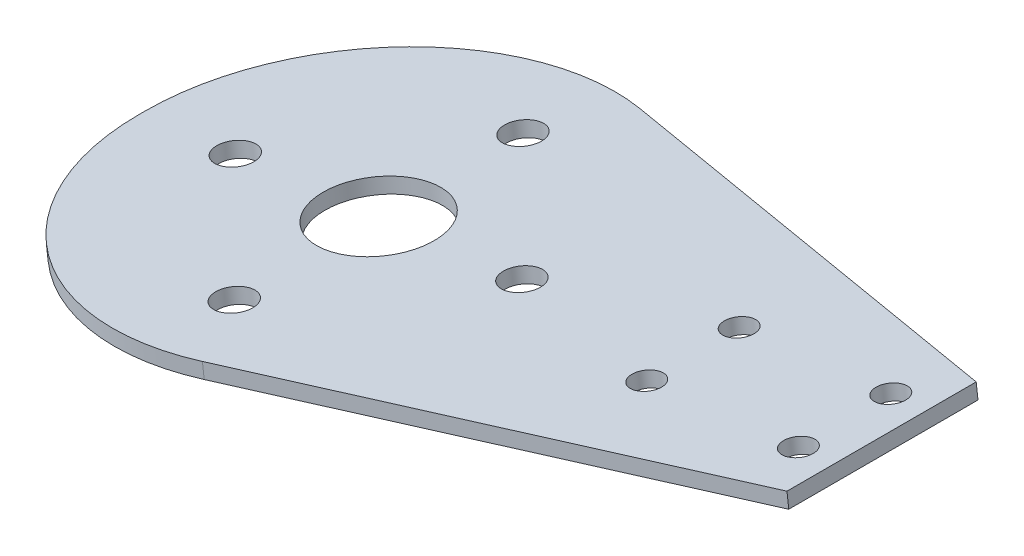
ISO-10303-21;
HEADER;
FILE_DESCRIPTION(('STEP AP214'),'2;1');
FILE_NAME('part.step','',(''),(''),'','','');
FILE_SCHEMA(('AUTOMOTIVE_DESIGN { 1 0 10303 214 1 1 1 1 }'));
ENDSEC;
DATA;
#1=APPLICATION_CONTEXT('core data for automotive mechanical design processes');
#2=APPLICATION_PROTOCOL_DEFINITION('international standard','automotive_design',2000,#1);
#3=PRODUCT_CONTEXT('',#1,'mechanical');
#4=PRODUCT('Part','Part','',(#3));
#5=PRODUCT_RELATED_PRODUCT_CATEGORY('part','',(#4));
#6=PRODUCT_DEFINITION_FORMATION('','',#4);
#7=PRODUCT_DEFINITION_CONTEXT('part definition',#1,'design');
#8=PRODUCT_DEFINITION('design','',#6,#7);
#9=PRODUCT_DEFINITION_SHAPE('','',#8);
#10=(LENGTH_UNIT() NAMED_UNIT(*) SI_UNIT(.MILLI.,.METRE.));
#11=(NAMED_UNIT(*) PLANE_ANGLE_UNIT() SI_UNIT($,.RADIAN.));
#12=(NAMED_UNIT(*) SI_UNIT($,.STERADIAN.) SOLID_ANGLE_UNIT());
#13=UNCERTAINTY_MEASURE_WITH_UNIT(LENGTH_MEASURE(1.E-05),#10,'distance_accuracy_value','');
#14=(GEOMETRIC_REPRESENTATION_CONTEXT(3) GLOBAL_UNCERTAINTY_ASSIGNED_CONTEXT((#13)) GLOBAL_UNIT_ASSIGNED_CONTEXT((#10,
#11,#12)) REPRESENTATION_CONTEXT('',''));
#15=CARTESIAN_POINT('',(0.,0.,0.));
#16=DIRECTION('',(0.,0.,1.));
#17=DIRECTION('',(1.,0.,0.));
#18=AXIS2_PLACEMENT_3D('',#15,#16,#17);
#19=CARTESIAN_POINT('',(-3583.17237333634,-433.611501662894,0.));
#20=DIRECTION('',(0.992757341933153,0.120136838804012,0.));
#21=DIRECTION('',(-0.120136838804012,0.992757341933153,0.));
#22=AXIS2_PLACEMENT_3D('',#19,#20,#21);
#23=PLANE('',#22);
#24=DIRECTION('',(0.,0.,1.));
#25=VECTOR('',#24,1.);
#26=CARTESIAN_POINT('',(-3586.22384903871,-408.395465204684,0.));
#27=LINE('',#26,#25);
#28=CARTESIAN_POINT('',(-3586.22384902271,-408.395465174607,0.7963161158));
#29=VERTEX_POINT('',#28);
#30=CARTESIAN_POINT('',(-3586.22384872111,-408.39546513811,-0.7963156247308));
#31=VERTEX_POINT('',#30);
#32=EDGE_CURVE('E76',#29,#31,#27,.F.);
#33=ORIENTED_EDGE('',*,*,#32,.F.);
#34=DIRECTION('',(-0.120136753304914,0.992757352279677,0.));
#35=VECTOR('',#34,1.);
#36=CARTESIAN_POINT('',(-3586.461719765,-406.4298056965,0.7963161158));
#37=LINE('',#36,#35);
#38=CARTESIAN_POINT('',(-3586.70439620694,-404.424435786048,0.796316115799999));
#39=VERTEX_POINT('',#38);
#40=EDGE_CURVE('E72',#29,#39,#37,.T.);
#41=ORIENTED_EDGE('',*,*,#40,.T.);
#42=DIRECTION('',(0.,0.,1.));
#43=VECTOR('',#42,1.);
#44=CARTESIAN_POINT('',(-3586.70439638072,-404.424435946072,0.));
#45=LINE('',#44,#43);
#46=CARTESIAN_POINT('',(-3586.70439653471,-404.424435825713,-0.796316115799763));
#47=VERTEX_POINT('',#46);
#48=EDGE_CURVE('E67',#47,#39,#45,.T.);
#49=ORIENTED_EDGE('',*,*,#48,.F.);
#50=DIRECTION('',(0.120137067988596,-0.992757314198713,2.45534482288628E-07));
#51=VECTOR('',#50,1.);
#52=CARTESIAN_POINT('',(-3586.46652376997,-406.390107782123,-0.796315629638174));
#53=LINE('',#52,#51);
#54=EDGE_CURVE('E69',#47,#31,#53,.T.);
#55=ORIENTED_EDGE('',*,*,#54,.T.);
#56=EDGE_LOOP('',(#33,#41,#49,#55));
#57=FACE_BOUND('',#56,.T.);
#58=ADVANCED_FACE('F17',(#57),#23,.F.);
#59=CARTESIAN_POINT('',(-3526.65840768473,-401.187257405238,-0.7963161158));
#60=DIRECTION('',(-0.1201370026744,0.992757322102643,0.));
#61=DIRECTION('',(-0.992757322102643,-0.1201370026744,0.));
#62=AXIS2_PLACEMENT_3D('',#59,#60,#61);
#63=CYLINDRICAL_SURFACE('',#62,60.0000000138993);
#64=DIRECTION('',(0.120136756247628,-0.992757351923569,-2.22863707248788E-08));
#65=VECTOR('',#64,1.);
#66=CARTESIAN_POINT('',(-3511.72228495053,-395.350603394013,-58.7518658759733));
#67=LINE('',#66,#65);
#68=CARTESIAN_POINT('',(-3511.72228516459,-395.350603332753,-58.7518657649794));
#69=VERTEX_POINT('',#68);
#70=CARTESIAN_POINT('',(-3511.24173779928,-399.3216326994,-58.7518657808039));
#71=VERTEX_POINT('',#70);
#72=EDGE_CURVE('E98',#69,#71,#67,.T.);
#73=ORIENTED_EDGE('',*,*,#72,.T.);
#74=CARTESIAN_POINT('',(-3526.65840800178,-401.187254785262,-0.7963161158));
#75=DIRECTION('',(-0.120136838804012,0.992757341933153,0.));
#76=DIRECTION('',(-0.992757341933153,-0.120136838804012,0.));
#77=AXIS2_PLACEMENT_3D('',#74,#75,#76);
#78=CIRCLE('',#77,60.0000000138993);
#79=EDGE_CURVE('E83',#71,#31,#78,.T.);
#80=ORIENTED_EDGE('',*,*,#79,.T.);
#81=ORIENTED_EDGE('',*,*,#54,.F.);
#82=CARTESIAN_POINT('',(-3527.1389560125,-397.216225496719,-0.796316115799996));
#83=DIRECTION('',(-0.120136838804012,0.992757341933153,0.));
#84=DIRECTION('',(-0.992757341933153,-0.120136838804012,0.));
#85=AXIS2_PLACEMENT_3D('',#82,#83,#84);
#86=CIRCLE('',#85,60.0000000138993);
#87=EDGE_CURVE('E20',#47,#69,#86,.F.);
#88=ORIENTED_EDGE('',*,*,#87,.T.);
#89=EDGE_LOOP('',(#73,#80,#81,#88));
#90=FACE_BOUND('',#89,.T.);
#91=ADVANCED_FACE('F80',(#90),#63,.T.);
#92=CARTESIAN_POINT('',(-3522.68737831009,-400.706705137537,0.));
#93=DIRECTION('',(-0.120136990747282,0.992757323545985,0.));
#94=DIRECTION('',(-0.992757323545985,-0.120136990747282,0.));
#95=AXIS2_PLACEMENT_3D('',#92,#93,#94);
#96=CYLINDRICAL_SURFACE('',#95,15.0000003644637);
#97=CARTESIAN_POINT('',(-3522.68737804135,-400.706707358321,0.));
#98=DIRECTION('',(-0.120136838804012,0.992757341933153,0.));
#99=DIRECTION('',(-0.992757341933153,-0.120136838804012,0.));
#100=AXIS2_PLACEMENT_3D('',#97,#98,#99);
#101=CIRCLE('',#100,15.0000003644637);
#102=CARTESIAN_POINT('',(-3537.57873853217,-402.508759984167,0.));
#103=VERTEX_POINT('',#102);
#104=EDGE_CURVE('E127',#103,#103,#101,.F.);
#105=ORIENTED_EDGE('',*,*,#104,.T.);
#106=EDGE_LOOP('',(#105));
#107=FACE_BOUND('',#106,.T.);
#108=CARTESIAN_POINT('',(-3523.16792600435,-396.735678064005,0.));
#109=DIRECTION('',(-0.120136838804012,0.992757341933153,0.));
#110=DIRECTION('',(-0.992757341933153,-0.120136838804012,0.));
#111=AXIS2_PLACEMENT_3D('',#108,#109,#110);
#112=CIRCLE('',#111,14.9999993777135);
#113=CARTESIAN_POINT('',(-3538.05928551557,-398.537730571305,0.));
#114=VERTEX_POINT('',#113);
#115=EDGE_CURVE('E90',#114,#114,#112,.T.);
#116=ORIENTED_EDGE('',*,*,#115,.T.);
#117=EDGE_LOOP('',(#116));
#118=FACE_BOUND('',#117,.T.);
#119=ADVANCED_FACE('F160',(#107,#118),#96,.F.);
#120=CARTESIAN_POINT('',(-3438.30300410119,-390.495075563839,12.4));
#121=DIRECTION('',(-0.12013699074812,0.992757323545884,0.));
#122=DIRECTION('',(-0.992757323545884,-0.12013699074812,0.));
#123=AXIS2_PLACEMENT_3D('',#120,#121,#122);
#124=CYLINDRICAL_SURFACE('',#123,4.00000012467592);
#125=CARTESIAN_POINT('',(-3438.30300404022,-390.495076067627,12.4));
#126=DIRECTION('',(-0.120136838804012,0.992757341933153,0.));
#127=DIRECTION('',(-0.992757341933153,-0.120136838804012,0.));
#128=AXIS2_PLACEMENT_3D('',#125,#126,#127);
#129=CIRCLE('',#128,4.00000012467592);
#130=CARTESIAN_POINT('',(-3442.27403353173,-390.975623437821,12.4));
#131=VERTEX_POINT('',#130);
#132=EDGE_CURVE('E124',#131,#131,#129,.F.);
#133=ORIENTED_EDGE('',*,*,#132,.T.);
#134=EDGE_LOOP('',(#133));
#135=FACE_BOUND('',#134,.T.);
#136=CARTESIAN_POINT('',(-3438.78355200323,-386.524046773311,12.4));
#137=DIRECTION('',(-0.120136838804012,0.992757341933153,0.));
#138=DIRECTION('',(-0.992757341933153,-0.120136838804012,0.));
#139=AXIS2_PLACEMENT_3D('',#136,#137,#138);
#140=CIRCLE('',#139,3.99999964031025);
#141=CARTESIAN_POINT('',(-3442.75458101388,-387.004594085315,12.4));
#142=VERTEX_POINT('',#141);
#143=EDGE_CURVE('E154',#142,#142,#140,.T.);
#144=ORIENTED_EDGE('',*,*,#143,.T.);
#145=EDGE_LOOP('',(#144));
#146=FACE_BOUND('',#145,.T.);
#147=ADVANCED_FACE('F245',(#135,#146),#124,.F.);
#148=CARTESIAN_POINT('',(-3397.59995310119,-385.569465163839,12.4));
#149=DIRECTION('',(-0.120136990748154,0.99275732354588,0.));
#150=DIRECTION('',(-0.99275732354588,-0.120136990748154,0.));
#151=AXIS2_PLACEMENT_3D('',#148,#149,#150);
#152=CYLINDRICAL_SURFACE('',#151,4.00000012467616);
#153=CARTESIAN_POINT('',(-3397.59995303887,-385.569465678829,12.4));
#154=DIRECTION('',(-0.120136838804012,0.992757341933153,0.));
#155=DIRECTION('',(-0.992757341933153,-0.120136838804012,0.));
#156=AXIS2_PLACEMENT_3D('',#153,#154,#155);
#157=CIRCLE('',#156,4.00000012467616);
#158=CARTESIAN_POINT('',(-3401.57098253037,-386.050013049024,12.4));
#159=VERTEX_POINT('',#158);
#160=EDGE_CURVE('E121',#159,#159,#157,.F.);
#161=ORIENTED_EDGE('',*,*,#160,.T.);
#162=EDGE_LOOP('',(#161));
#163=FACE_BOUND('',#162,.T.);
#164=CARTESIAN_POINT('',(-3398.08050100187,-381.598436384513,12.4));
#165=DIRECTION('',(-0.120136838804012,0.992757341933153,0.));
#166=DIRECTION('',(-0.992757341933153,-0.120136838804012,0.));
#167=AXIS2_PLACEMENT_3D('',#164,#165,#166);
#168=CIRCLE('',#167,3.99999964031093);
#169=CARTESIAN_POINT('',(-3402.05153001252,-382.078983696517,12.4));
#170=VERTEX_POINT('',#169);
#171=EDGE_CURVE('E151',#170,#170,#168,.T.);
#172=ORIENTED_EDGE('',*,*,#171,.T.);
#173=EDGE_LOOP('',(#172));
#174=FACE_BOUND('',#173,.T.);
#175=ADVANCED_FACE('F251',(#163,#174),#152,.F.);
#176=CARTESIAN_POINT('',(-3438.30300410119,-390.495075563839,-12.4));
#177=DIRECTION('',(-0.12013699074812,0.992757323545884,0.));
#178=DIRECTION('',(-0.992757323545884,-0.12013699074812,0.));
#179=AXIS2_PLACEMENT_3D('',#176,#177,#178);
#180=CYLINDRICAL_SURFACE('',#179,4.00000012467592);
#181=CARTESIAN_POINT('',(-3438.30300404022,-390.495076067627,-12.4));
#182=DIRECTION('',(-0.120136838804012,0.992757341933153,0.));
#183=DIRECTION('',(-0.992757341933153,-0.120136838804012,0.));
#184=AXIS2_PLACEMENT_3D('',#181,#182,#183);
#185=CIRCLE('',#184,4.00000012467592);
#186=CARTESIAN_POINT('',(-3442.27403353173,-390.975623437821,-12.4));
#187=VERTEX_POINT('',#186);
#188=EDGE_CURVE('E118',#187,#187,#185,.F.);
#189=ORIENTED_EDGE('',*,*,#188,.T.);
#190=EDGE_LOOP('',(#189));
#191=FACE_BOUND('',#190,.T.);
#192=CARTESIAN_POINT('',(-3438.78355200323,-386.524046773311,-12.4));
#193=DIRECTION('',(-0.120136838804012,0.992757341933153,0.));
#194=DIRECTION('',(-0.992757341933153,-0.120136838804012,0.));
#195=AXIS2_PLACEMENT_3D('',#192,#193,#194);
#196=CIRCLE('',#195,3.99999964031025);
#197=CARTESIAN_POINT('',(-3442.75458101388,-387.004594085315,-12.4));
#198=VERTEX_POINT('',#197);
#199=EDGE_CURVE('E148',#198,#198,#196,.T.);
#200=ORIENTED_EDGE('',*,*,#199,.T.);
#201=EDGE_LOOP('',(#200));
#202=FACE_BOUND('',#201,.T.);
#203=ADVANCED_FACE('F257',(#191,#202),#180,.F.);
#204=CARTESIAN_POINT('',(-3397.59995310119,-385.569465163839,-12.4));
#205=DIRECTION('',(-0.120136990748154,0.99275732354588,0.));
#206=DIRECTION('',(-0.99275732354588,-0.120136990748154,0.));
#207=AXIS2_PLACEMENT_3D('',#204,#205,#206);
#208=CYLINDRICAL_SURFACE('',#207,4.00000012467616);
#209=CARTESIAN_POINT('',(-3397.59995303887,-385.569465678829,-12.4));
#210=DIRECTION('',(-0.120136838804012,0.992757341933153,0.));
#211=DIRECTION('',(-0.992757341933153,-0.120136838804012,0.));
#212=AXIS2_PLACEMENT_3D('',#209,#210,#211);
#213=CIRCLE('',#212,4.00000012467616);
#214=CARTESIAN_POINT('',(-3401.57098253037,-386.050013049024,-12.4));
#215=VERTEX_POINT('',#214);
#216=EDGE_CURVE('E115',#215,#215,#213,.F.);
#217=ORIENTED_EDGE('',*,*,#216,.T.);
#218=EDGE_LOOP('',(#217));
#219=FACE_BOUND('',#218,.T.);
#220=CARTESIAN_POINT('',(-3398.08050100187,-381.598436384513,-12.4));
#221=DIRECTION('',(-0.120136838804012,0.992757341933153,0.));
#222=DIRECTION('',(-0.992757341933153,-0.120136838804012,0.));
#223=AXIS2_PLACEMENT_3D('',#220,#221,#222);
#224=CIRCLE('',#223,3.99999964031093);
#225=CARTESIAN_POINT('',(-3402.05153001252,-382.078983696517,-12.4));
#226=VERTEX_POINT('',#225);
#227=EDGE_CURVE('E145',#226,#226,#224,.T.);
#228=ORIENTED_EDGE('',*,*,#227,.T.);
#229=EDGE_LOOP('',(#228));
#230=FACE_BOUND('',#229,.T.);
#231=ADVANCED_FACE('F261',(#219,#230),#208,.F.);
#232=CARTESIAN_POINT('',(-3561.15672493095,-405.362010770633,0.));
#233=DIRECTION('',(-0.120136990748568,0.992757323545829,0.));
#234=DIRECTION('',(-0.992757323545829,-0.120136990748568,0.));
#235=AXIS2_PLACEMENT_3D('',#232,#233,#234);
#236=CYLINDRICAL_SURFACE('',#235,4.99999979257135);
#237=CARTESIAN_POINT('',(-3561.63727300392,-401.390980567619,0.));
#238=DIRECTION('',(-0.120136838804012,0.992757341933153,0.));
#239=DIRECTION('',(-0.992757341933153,-0.120136838804012,0.));
#240=AXIS2_PLACEMENT_3D('',#237,#238,#239);
#241=CIRCLE('',#240,5.0000002889494);
#242=CARTESIAN_POINT('',(-3566.60106000044,-401.991664796352,0.));
#243=VERTEX_POINT('',#242);
#244=EDGE_CURVE('E142',#243,#243,#241,.T.);
#245=ORIENTED_EDGE('',*,*,#244,.T.);
#246=EDGE_LOOP('',(#245));
#247=FACE_BOUND('',#246,.T.);
#248=CARTESIAN_POINT('',(-3561.15672504091,-405.362009861935,0.));
#249=DIRECTION('',(-0.120136838804012,0.992757341933153,0.));
#250=DIRECTION('',(-0.992757341933153,-0.120136838804012,0.));
#251=AXIS2_PLACEMENT_3D('',#248,#249,#250);
#252=CIRCLE('',#251,4.99999979257135);
#253=CARTESIAN_POINT('',(-3566.12051154465,-405.962694031035,0.));
#254=VERTEX_POINT('',#253);
#255=EDGE_CURVE('E112',#254,#254,#252,.F.);
#256=ORIENTED_EDGE('',*,*,#255,.T.);
#257=EDGE_LOOP('',(#256));
#258=FACE_BOUND('',#257,.T.);
#259=ADVANCED_FACE('F265',(#247,#258),#236,.F.);
#260=CARTESIAN_POINT('',(-3522.68737802636,-400.706707482177,38.75));
#261=DIRECTION('',(-0.120136990747278,0.992757323545985,0.));
#262=DIRECTION('',(-0.992757323545985,-0.120136990747278,0.));
#263=AXIS2_PLACEMENT_3D('',#260,#261,#262);
#264=CYLINDRICAL_SURFACE('',#263,5.00000000000004);
#265=CARTESIAN_POINT('',(-3523.16792598807,-396.735678198557,38.75));
#266=DIRECTION('',(-0.120136990747289,0.992757323545984,0.));
#267=DIRECTION('',(-0.992757323545984,-0.120136990747289,0.));
#268=AXIS2_PLACEMENT_3D('',#265,#266,#267);
#269=CIRCLE('',#268,5.00000000000005);
#270=CARTESIAN_POINT('',(-3528.1317126058,-397.336363152293,38.75));
#271=VERTEX_POINT('',#270);
#272=EDGE_CURVE('E139',#271,#271,#269,.T.);
#273=ORIENTED_EDGE('',*,*,#272,.T.);
#274=EDGE_LOOP('',(#273));
#275=FACE_BOUND('',#274,.T.);
#276=CARTESIAN_POINT('',(-3522.68737802636,-400.706707482177,38.75));
#277=DIRECTION('',(-0.120136990747278,0.992757323545985,0.));
#278=DIRECTION('',(-0.992757323545985,-0.120136990747278,0.));
#279=AXIS2_PLACEMENT_3D('',#276,#277,#278);
#280=CIRCLE('',#279,5.00000000000004);
#281=CARTESIAN_POINT('',(-3527.65116464409,-401.307392435913,38.75));
#282=VERTEX_POINT('',#281);
#283=EDGE_CURVE('E109',#282,#282,#280,.F.);
#284=ORIENTED_EDGE('',*,*,#283,.T.);
#285=EDGE_LOOP('',(#284));
#286=FACE_BOUND('',#285,.T.);
#287=ADVANCED_FACE('F269',(#275,#286),#264,.F.);
#288=CARTESIAN_POINT('',(-3484.21803093095,-396.051405770631,0.));
#289=DIRECTION('',(-0.120136990748158,0.992757323545879,0.));
#290=DIRECTION('',(-0.992757323545879,-0.120136990748158,0.));
#291=AXIS2_PLACEMENT_3D('',#288,#289,#290);
#292=CYLINDRICAL_SURFACE('',#291,4.99999979257133);
#293=CARTESIAN_POINT('',(-3484.69857900479,-392.080375560391,0.));
#294=DIRECTION('',(-0.120136838804012,0.992757341933153,0.));
#295=DIRECTION('',(-0.992757341933153,-0.120136838804012,0.));
#296=AXIS2_PLACEMENT_3D('',#293,#294,#295);
#297=CIRCLE('',#296,5.00000028294328);
#298=CARTESIAN_POINT('',(-3489.66236599535,-392.681059788403,0.));
#299=VERTEX_POINT('',#298);
#300=EDGE_CURVE('E136',#299,#299,#297,.T.);
#301=ORIENTED_EDGE('',*,*,#300,.T.);
#302=EDGE_LOOP('',(#301));
#303=FACE_BOUND('',#302,.T.);
#304=CARTESIAN_POINT('',(-3484.21803104178,-396.051404854708,0.));
#305=DIRECTION('',(-0.120136838804012,0.992757341933153,0.));
#306=DIRECTION('',(-0.992757341933153,-0.120136838804012,0.));
#307=AXIS2_PLACEMENT_3D('',#304,#305,#306);
#308=CIRCLE('',#307,4.99999979257133);
#309=CARTESIAN_POINT('',(-3489.18181754552,-396.652089023808,0.));
#310=VERTEX_POINT('',#309);
#311=EDGE_CURVE('E106',#310,#310,#308,.F.);
#312=ORIENTED_EDGE('',*,*,#311,.T.);
#313=EDGE_LOOP('',(#312));
#314=FACE_BOUND('',#313,.T.);
#315=ADVANCED_FACE('F273',(#303,#314),#292,.F.);
#316=CARTESIAN_POINT('',(-3522.68737802636,-400.706707482177,-38.75));
#317=DIRECTION('',(-0.120136990747278,0.992757323545985,0.));
#318=DIRECTION('',(-0.992757323545985,-0.120136990747278,0.));
#319=AXIS2_PLACEMENT_3D('',#316,#317,#318);
#320=CYLINDRICAL_SURFACE('',#319,5.00000000000005);
#321=CARTESIAN_POINT('',(-3523.16792598807,-396.735678198557,-38.75));
#322=DIRECTION('',(-0.120136990747289,0.992757323545984,0.));
#323=DIRECTION('',(-0.992757323545984,-0.120136990747289,0.));
#324=AXIS2_PLACEMENT_3D('',#321,#322,#323);
#325=CIRCLE('',#324,5.00000000000004);
#326=CARTESIAN_POINT('',(-3528.1317126058,-397.336363152293,-38.75));
#327=VERTEX_POINT('',#326);
#328=EDGE_CURVE('E133',#327,#327,#325,.T.);
#329=ORIENTED_EDGE('',*,*,#328,.T.);
#330=EDGE_LOOP('',(#329));
#331=FACE_BOUND('',#330,.T.);
#332=CARTESIAN_POINT('',(-3522.68737802636,-400.706707482177,-38.75));
#333=DIRECTION('',(-0.120136990747278,0.992757323545985,0.));
#334=DIRECTION('',(-0.992757323545985,-0.120136990747278,0.));
#335=AXIS2_PLACEMENT_3D('',#332,#333,#334);
#336=CIRCLE('',#335,5.00000000000005);
#337=CARTESIAN_POINT('',(-3527.65116464409,-401.307392435913,-38.75));
#338=VERTEX_POINT('',#337);
#339=EDGE_CURVE('E102',#338,#338,#336,.F.);
#340=ORIENTED_EDGE('',*,*,#339,.T.);
#341=EDGE_LOOP('',(#340));
#342=FACE_BOUND('',#341,.T.);
#343=ADVANCED_FACE('F175',(#331,#342),#320,.F.);
#344=CARTESIAN_POINT('',(-3526.65552438308,-401.211083693252,0.7963161158));
#345=DIRECTION('',(-0.120137002674399,0.992757322102643,0.));
#346=DIRECTION('',(-0.992757322102643,-0.120137002674399,0.));
#347=AXIS2_PLACEMENT_3D('',#344,#345,#346);
#348=CYLINDRICAL_SURFACE('',#347,59.9999999897553);
#349=ORIENTED_EDGE('',*,*,#40,.F.);
#350=CARTESIAN_POINT('',(-3526.65840800178,-401.187254785262,0.7963161158));
#351=DIRECTION('',(-0.120136838804012,0.992757341933153,0.));
#352=DIRECTION('',(-0.992757341933153,-0.120136838804012,0.));
#353=AXIS2_PLACEMENT_3D('',#350,#351,#352);
#354=CIRCLE('',#353,59.9999999897553);
#355=CARTESIAN_POINT('',(-3511.24173772438,-399.321632728491,58.7518659104803));
#356=VERTEX_POINT('',#355);
#357=EDGE_CURVE('E97',#29,#356,#354,.T.);
#358=ORIENTED_EDGE('',*,*,#357,.T.);
#359=DIRECTION('',(-0.120136756247628,0.992757351923569,-2.22863707248788E-08));
#360=VECTOR('',#359,1.);
#361=CARTESIAN_POINT('',(-3511.24173792682,-399.321632791144,58.7518659651188));
#362=LINE('',#361,#360);
#363=CARTESIAN_POINT('',(-3511.72228516774,-395.350603333135,58.7518657533317));
#364=VERTEX_POINT('',#363);
#365=EDGE_CURVE('E222',#356,#364,#362,.T.);
#366=ORIENTED_EDGE('',*,*,#365,.T.);
#367=CARTESIAN_POINT('',(-3527.1389560125,-397.216225496719,0.796316115799998));
#368=DIRECTION('',(-0.120136838804012,0.992757341933153,0.));
#369=DIRECTION('',(-0.992757341933153,-0.120136838804012,0.));
#370=AXIS2_PLACEMENT_3D('',#367,#368,#369);
#371=CIRCLE('',#370,59.9999999897553);
#372=EDGE_CURVE('E89',#364,#39,#371,.F.);
#373=ORIENTED_EDGE('',*,*,#372,.T.);
#374=EDGE_LOOP('',(#349,#358,#366,#373));
#375=FACE_BOUND('',#374,.T.);
#376=ADVANCED_FACE('F164',(#375),#348,.T.);
#377=CARTESIAN_POINT('',(-3.5320230609559,29.1870658538094,0.));
#378=DIRECTION('',(-0.120136838804012,0.992757341933153,0.));
#379=DIRECTION('',(-0.992757341933153,-0.120136838804012,0.));
#380=AXIS2_PLACEMENT_3D('',#377,#378,#379);
#381=PLANE('',#380);
#382=ORIENTED_EDGE('',*,*,#328,.F.);
#383=EDGE_LOOP('',(#382));
#384=FACE_BOUND('',#383,.T.);
#385=ORIENTED_EDGE('',*,*,#300,.F.);
#386=EDGE_LOOP('',(#385));
#387=FACE_BOUND('',#386,.T.);
#388=ORIENTED_EDGE('',*,*,#272,.F.);
#389=EDGE_LOOP('',(#388));
#390=FACE_BOUND('',#389,.T.);
#391=ORIENTED_EDGE('',*,*,#244,.F.);
#392=EDGE_LOOP('',(#391));
#393=FACE_BOUND('',#392,.T.);
#394=ORIENTED_EDGE('',*,*,#227,.F.);
#395=EDGE_LOOP('',(#394));
#396=FACE_BOUND('',#395,.T.);
#397=ORIENTED_EDGE('',*,*,#199,.F.);
#398=EDGE_LOOP('',(#397));
#399=FACE_BOUND('',#398,.T.);
#400=ORIENTED_EDGE('',*,*,#171,.F.);
#401=EDGE_LOOP('',(#400));
#402=FACE_BOUND('',#401,.T.);
#403=ORIENTED_EDGE('',*,*,#143,.F.);
#404=EDGE_LOOP('',(#403));
#405=FACE_BOUND('',#404,.T.);
#406=ORIENTED_EDGE('',*,*,#115,.F.);
#407=EDGE_LOOP('',(#406));
#408=FACE_BOUND('',#407,.T.);
#409=ORIENTED_EDGE('',*,*,#372,.F.);
#410=DIRECTION('',(0.95892995576973,0.116043275549537,-0.258819045140032));
#411=VECTOR('',#410,1.);
#412=CARTESIAN_POINT('',(-3511.72228495053,-395.350603394013,58.7518658759733));
#413=LINE('',#412,#411);
#414=CARTESIAN_POINT('',(-3388.15292796202,-380.397068082152,25.4000001433352));
#415=VERTEX_POINT('',#414);
#416=EDGE_CURVE('E105',#364,#415,#413,.T.);
#417=ORIENTED_EDGE('',*,*,#416,.T.);
#418=DIRECTION('',(0.,0.,1.));
#419=VECTOR('',#418,1.);
#420=CARTESIAN_POINT('',(-3388.15292799771,-380.397068099723,0.));
#421=LINE('',#420,#419);
#422=CARTESIAN_POINT('',(-3388.15292797392,-380.397068088009,-25.400000119458));
#423=VERTEX_POINT('',#422);
#424=EDGE_CURVE('E219',#415,#423,#421,.F.);
#425=ORIENTED_EDGE('',*,*,#424,.T.);
#426=DIRECTION('',(-0.95892995576973,-0.116043275549537,-0.258819045140032));
#427=VECTOR('',#426,1.);
#428=CARTESIAN_POINT('',(-3388.15292792371,-380.397068090767,-25.4000002868144));
#429=LINE('',#428,#427);
#430=EDGE_CURVE('E87',#423,#69,#429,.T.);
#431=ORIENTED_EDGE('',*,*,#430,.T.);
#432=ORIENTED_EDGE('',*,*,#87,.F.);
#433=ORIENTED_EDGE('',*,*,#48,.T.);
#434=EDGE_LOOP('',(#409,#417,#425,#431,#432,#433));
#435=FACE_BOUND('',#434,.T.);
#436=ADVANCED_FACE('F85',(#384,#387,#390,#393,#396,#399,#402,#405,#408,#435),#381,.T.);
#437=CARTESIAN_POINT('',(-220.422600408264,-26.6740655534597,828.629826229201));
#438=DIRECTION('',(0.256944507294418,0.0310937019093246,-0.965925826279018));
#439=DIRECTION('',(-0.966393102516627,0.,-0.257068806758597));
#440=AXIS2_PLACEMENT_3D('',#437,#438,#439);
#441=PLANE('',#440);
#442=DIRECTION('',(-0.120136838804012,0.992757341933153,0.));
#443=VECTOR('',#442,1.);
#444=CARTESIAN_POINT('',(-3384.62090494308,-409.584133901289,-25.4));
#445=LINE('',#444,#443);
#446=CARTESIAN_POINT('',(-3387.6723803244,-384.368097457672,-25.4000000319426));
#447=VERTEX_POINT('',#446);
#448=EDGE_CURVE('E217',#423,#447,#445,.F.);
#449=ORIENTED_EDGE('',*,*,#448,.T.);
#450=DIRECTION('',(-0.958929956105512,-0.116043275325123,-0.25881904399657));
#451=VECTOR('',#450,1.);
#452=CARTESIAN_POINT('',(-3387.67238001946,-384.368097339186,-25.4));
#453=LINE('',#452,#451);
#454=EDGE_CURVE('E131',#447,#71,#453,.T.);
#455=ORIENTED_EDGE('',*,*,#454,.T.);
#456=ORIENTED_EDGE('',*,*,#72,.F.);
#457=ORIENTED_EDGE('',*,*,#430,.F.);
#458=EDGE_LOOP('',(#449,#455,#456,#457));
#459=FACE_BOUND('',#458,.T.);
#460=ADVANCED_FACE('F163',(#459),#441,.T.);
#461=CARTESIAN_POINT('',(-3.05147570572381,25.2160364859442,0.));
#462=DIRECTION('',(-0.120136838804012,0.992757341933153,0.));
#463=DIRECTION('',(-0.992757341933153,-0.120136838804012,0.));
#464=AXIS2_PLACEMENT_3D('',#461,#462,#463);
#465=PLANE('',#464);
#466=ORIENTED_EDGE('',*,*,#339,.F.);
#467=EDGE_LOOP('',(#466));
#468=FACE_BOUND('',#467,.T.);
#469=ORIENTED_EDGE('',*,*,#311,.F.);
#470=EDGE_LOOP('',(#469));
#471=FACE_BOUND('',#470,.T.);
#472=ORIENTED_EDGE('',*,*,#283,.F.);
#473=EDGE_LOOP('',(#472));
#474=FACE_BOUND('',#473,.T.);
#475=ORIENTED_EDGE('',*,*,#255,.F.);
#476=EDGE_LOOP('',(#475));
#477=FACE_BOUND('',#476,.T.);
#478=ORIENTED_EDGE('',*,*,#216,.F.);
#479=EDGE_LOOP('',(#478));
#480=FACE_BOUND('',#479,.T.);
#481=ORIENTED_EDGE('',*,*,#188,.F.);
#482=EDGE_LOOP('',(#481));
#483=FACE_BOUND('',#482,.T.);
#484=ORIENTED_EDGE('',*,*,#160,.F.);
#485=EDGE_LOOP('',(#484));
#486=FACE_BOUND('',#485,.T.);
#487=ORIENTED_EDGE('',*,*,#132,.F.);
#488=EDGE_LOOP('',(#487));
#489=FACE_BOUND('',#488,.T.);
#490=ORIENTED_EDGE('',*,*,#104,.F.);
#491=EDGE_LOOP('',(#490));
#492=FACE_BOUND('',#491,.T.);
#493=ORIENTED_EDGE('',*,*,#454,.F.);
#494=DIRECTION('',(0.,0.,1.));
#495=VECTOR('',#494,1.);
#496=CARTESIAN_POINT('',(-3387.67238062934,-384.368097576159,0.));
#497=LINE('',#496,#495);
#498=CARTESIAN_POINT('',(-3387.67238011281,-384.368097513651,25.4000001673911));
#499=VERTEX_POINT('',#498);
#500=EDGE_CURVE('E26',#447,#499,#497,.T.);
#501=ORIENTED_EDGE('',*,*,#500,.T.);
#502=DIRECTION('',(-0.958929955881733,-0.116043274623996,0.258819045140031));
#503=VECTOR('',#502,1.);
#504=CARTESIAN_POINT('',(-3387.67237996601,-384.368097495887,25.4000001277703));
#505=LINE('',#504,#503);
#506=EDGE_CURVE('E229',#499,#356,#505,.T.);
#507=ORIENTED_EDGE('',*,*,#506,.T.);
#508=ORIENTED_EDGE('',*,*,#357,.F.);
#509=ORIENTED_EDGE('',*,*,#32,.T.);
#510=ORIENTED_EDGE('',*,*,#79,.F.);
#511=EDGE_LOOP('',(#493,#501,#507,#508,#509,#510));
#512=FACE_BOUND('',#511,.T.);
#513=ADVANCED_FACE('F172',(#468,#471,#474,#477,#480,#483,#486,#489,#492,#512),#465,.F.);
#514=CARTESIAN_POINT('',(-220.422600408264,-26.6740655534597,-828.629826229201));
#515=DIRECTION('',(-0.256944507294418,-0.0310937019093246,-0.965925826279018));
#516=DIRECTION('',(-0.966393102516627,0.,0.257068806758597));
#517=AXIS2_PLACEMENT_3D('',#514,#515,#516);
#518=PLANE('',#517);
#519=ORIENTED_EDGE('',*,*,#506,.F.);
#520=DIRECTION('',(-0.120136838804012,0.992757341933153,0.));
#521=VECTOR('',#520,1.);
#522=CARTESIAN_POINT('',(-3384.62090494308,-409.584133901289,25.4));
#523=LINE('',#522,#521);
#524=EDGE_CURVE('E11',#499,#415,#523,.T.);
#525=ORIENTED_EDGE('',*,*,#524,.T.);
#526=ORIENTED_EDGE('',*,*,#416,.F.);
#527=ORIENTED_EDGE('',*,*,#365,.F.);
#528=EDGE_LOOP('',(#519,#525,#526,#527));
#529=FACE_BOUND('',#528,.T.);
#530=ADVANCED_FACE('F182',(#529),#518,.F.);
#531=CARTESIAN_POINT('',(-3384.62090494308,-409.584133901289,0.));
#532=DIRECTION('',(0.992757341933153,0.120136838804012,0.));
#533=DIRECTION('',(-0.120136838804012,0.992757341933153,0.));
#534=AXIS2_PLACEMENT_3D('',#531,#532,#533);
#535=PLANE('',#534);
#536=ORIENTED_EDGE('',*,*,#500,.F.);
#537=ORIENTED_EDGE('',*,*,#448,.F.);
#538=ORIENTED_EDGE('',*,*,#424,.F.);
#539=ORIENTED_EDGE('',*,*,#524,.F.);
#540=EDGE_LOOP('',(#536,#537,#538,#539));
#541=FACE_BOUND('',#540,.T.);
#542=ADVANCED_FACE('F180',(#541),#535,.T.);
#543=CLOSED_SHELL('',(#58,#91,#119,#147,#175,#203,#231,#259,#287,#315,#343,#376,#436,#460,#513,
#530,#542));
#544=MANIFOLD_SOLID_BREP('B1',#543);
#545=ADVANCED_BREP_SHAPE_REPRESENTATION('',(#18,#544),#14);
#546=SHAPE_DEFINITION_REPRESENTATION(#9,#545);
ENDSEC;
END-ISO-10303-21;
